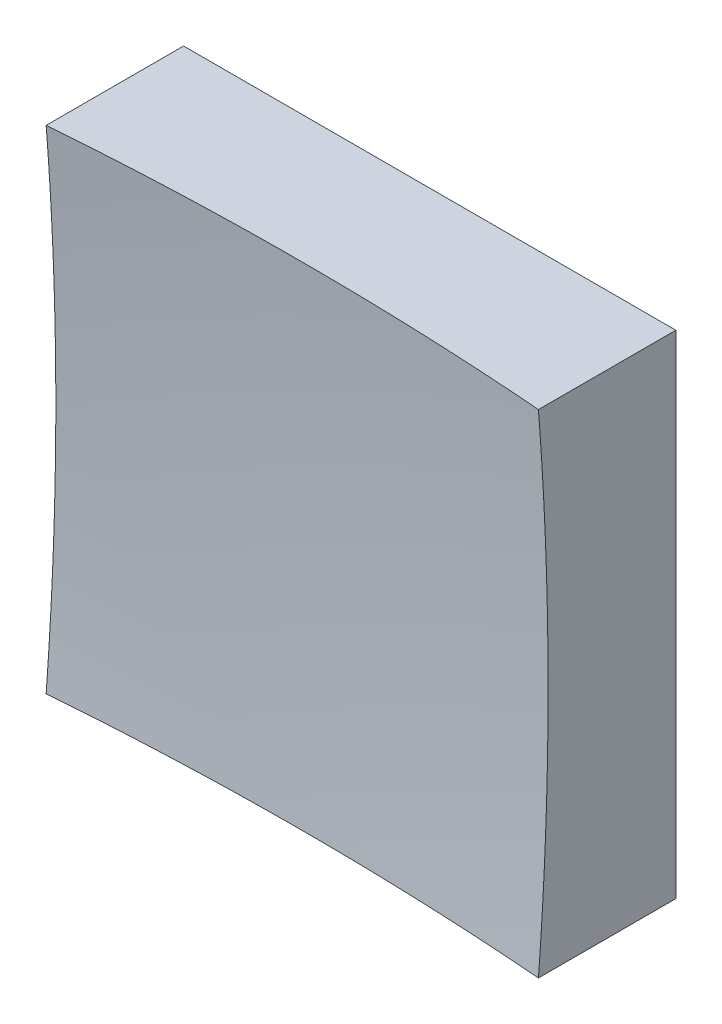
ISO-10303-21;
HEADER;
FILE_DESCRIPTION(('STEP AP214'),'2;1');
FILE_NAME('part.step','',(''),(''),'','','');
FILE_SCHEMA(('AUTOMOTIVE_DESIGN { 1 0 10303 214 1 1 1 1 }'));
ENDSEC;
DATA;
#1=APPLICATION_CONTEXT('core data for automotive mechanical design processes');
#2=APPLICATION_PROTOCOL_DEFINITION('international standard','automotive_design',2000,#1);
#3=PRODUCT_CONTEXT('',#1,'mechanical');
#4=PRODUCT('Part','Part','',(#3));
#5=PRODUCT_RELATED_PRODUCT_CATEGORY('part','',(#4));
#6=PRODUCT_DEFINITION_FORMATION('','',#4);
#7=PRODUCT_DEFINITION_CONTEXT('part definition',#1,'design');
#8=PRODUCT_DEFINITION('design','',#6,#7);
#9=PRODUCT_DEFINITION_SHAPE('','',#8);
#10=(LENGTH_UNIT() NAMED_UNIT(*) SI_UNIT(.MILLI.,.METRE.));
#11=(NAMED_UNIT(*) PLANE_ANGLE_UNIT() SI_UNIT($,.RADIAN.));
#12=(NAMED_UNIT(*) SI_UNIT($,.STERADIAN.) SOLID_ANGLE_UNIT());
#13=UNCERTAINTY_MEASURE_WITH_UNIT(LENGTH_MEASURE(1.E-05),#10,'distance_accuracy_value','');
#14=(GEOMETRIC_REPRESENTATION_CONTEXT(3) GLOBAL_UNCERTAINTY_ASSIGNED_CONTEXT((#13)) GLOBAL_UNIT_ASSIGNED_CONTEXT((#10,
#11,#12)) REPRESENTATION_CONTEXT('',''));
#15=CARTESIAN_POINT('',(0.,0.,0.));
#16=DIRECTION('',(0.,0.,1.));
#17=DIRECTION('',(1.,0.,0.));
#18=AXIS2_PLACEMENT_3D('',#15,#16,#17);
#19=CARTESIAN_POINT('',(-6.25,6.25,10.));
#20=DIRECTION('',(0.,1.,0.));
#21=DIRECTION('',(0.,0.,1.));
#22=AXIS2_PLACEMENT_3D('',#19,#20,#21);
#23=PLANE('',#22);
#24=CARTESIAN_POINT('',(0.,6.25,83.));
#25=DIRECTION('',(0.,1.,0.));
#26=DIRECTION('',(0.,0.,1.));
#27=AXIS2_PLACEMENT_3D('',#24,#25,#26);
#28=CIRCLE('',#27,79.7554857047463);
#29=CARTESIAN_POINT('',(6.25,6.25,3.48978053105375));
#30=VERTEX_POINT('',#29);
#31=CARTESIAN_POINT('',(-6.25,6.25,3.48978053105375));
#32=VERTEX_POINT('',#31);
#33=EDGE_CURVE('E79',#30,#32,#28,.T.);
#34=ORIENTED_EDGE('',*,*,#33,.F.);
#35=DIRECTION('',(0.,0.,-1.));
#36=VECTOR('',#35,1.);
#37=CARTESIAN_POINT('',(6.25,6.25,10.));
#38=LINE('',#37,#36);
#39=CARTESIAN_POINT('',(6.25,6.25,0.));
#40=VERTEX_POINT('',#39);
#41=EDGE_CURVE('E85',#30,#40,#38,.T.);
#42=ORIENTED_EDGE('',*,*,#41,.T.);
#43=DIRECTION('',(1.,0.,0.));
#44=VECTOR('',#43,1.);
#45=CARTESIAN_POINT('',(-6.25,6.25,0.));
#46=LINE('',#45,#44);
#47=CARTESIAN_POINT('',(-6.25,6.25,0.));
#48=VERTEX_POINT('',#47);
#49=EDGE_CURVE('E88',#48,#40,#46,.T.);
#50=ORIENTED_EDGE('',*,*,#49,.F.);
#51=DIRECTION('',(0.,0.,-1.));
#52=VECTOR('',#51,1.);
#53=CARTESIAN_POINT('',(-6.25,6.25,10.));
#54=LINE('',#53,#52);
#55=EDGE_CURVE('E47',#32,#48,#54,.T.);
#56=ORIENTED_EDGE('',*,*,#55,.F.);
#57=EDGE_LOOP('',(#34,#42,#50,#56));
#58=FACE_BOUND('',#57,.T.);
#59=ADVANCED_FACE('F39',(#58),#23,.T.);
#60=CARTESIAN_POINT('',(-6.25,6.25,10.));
#61=DIRECTION('',(1.,0.,0.));
#62=DIRECTION('',(0.,0.,-1.));
#63=AXIS2_PLACEMENT_3D('',#60,#61,#62);
#64=PLANE('',#63);
#65=DIRECTION('',(0.,0.,-1.));
#66=VECTOR('',#65,1.);
#67=CARTESIAN_POINT('',(-6.25,-6.25,10.));
#68=LINE('',#67,#66);
#69=CARTESIAN_POINT('',(-6.25,-6.25,3.48978053105375));
#70=VERTEX_POINT('',#69);
#71=CARTESIAN_POINT('',(-6.25,-6.25,0.));
#72=VERTEX_POINT('',#71);
#73=EDGE_CURVE('E100',#70,#72,#68,.T.);
#74=ORIENTED_EDGE('',*,*,#73,.F.);
#75=CARTESIAN_POINT('',(-6.25,0.,83.));
#76=DIRECTION('',(1.,0.,0.));
#77=DIRECTION('',(0.,0.,-1.));
#78=AXIS2_PLACEMENT_3D('',#75,#76,#77);
#79=CIRCLE('',#78,79.7554857047463);
#80=EDGE_CURVE('E89',#70,#32,#79,.T.);
#81=ORIENTED_EDGE('',*,*,#80,.T.);
#82=ORIENTED_EDGE('',*,*,#55,.T.);
#83=DIRECTION('',(0.,-1.,0.));
#84=VECTOR('',#83,1.);
#85=CARTESIAN_POINT('',(-6.25,6.25,0.));
#86=LINE('',#85,#84);
#87=EDGE_CURVE('E97',#48,#72,#86,.T.);
#88=ORIENTED_EDGE('',*,*,#87,.T.);
#89=EDGE_LOOP('',(#74,#81,#82,#88));
#90=FACE_BOUND('',#89,.T.);
#91=ADVANCED_FACE('F122',(#90),#64,.F.);
#92=CARTESIAN_POINT('',(-6.25,-6.25,10.));
#93=DIRECTION('',(0.,1.,0.));
#94=DIRECTION('',(0.,0.,1.));
#95=AXIS2_PLACEMENT_3D('',#92,#93,#94);
#96=PLANE('',#95);
#97=DIRECTION('',(0.,0.,-1.));
#98=VECTOR('',#97,1.);
#99=CARTESIAN_POINT('',(6.25,-6.25,10.));
#100=LINE('',#99,#98);
#101=CARTESIAN_POINT('',(6.25,-6.25,3.48978053105375));
#102=VERTEX_POINT('',#101);
#103=CARTESIAN_POINT('',(6.25,-6.25,0.));
#104=VERTEX_POINT('',#103);
#105=EDGE_CURVE('E96',#102,#104,#100,.T.);
#106=ORIENTED_EDGE('',*,*,#105,.F.);
#107=CARTESIAN_POINT('',(0.,-6.25,83.));
#108=DIRECTION('',(0.,1.,0.));
#109=DIRECTION('',(0.,0.,1.));
#110=AXIS2_PLACEMENT_3D('',#107,#108,#109);
#111=CIRCLE('',#110,79.7554857047463);
#112=EDGE_CURVE('E53',#102,#70,#111,.T.);
#113=ORIENTED_EDGE('',*,*,#112,.T.);
#114=ORIENTED_EDGE('',*,*,#73,.T.);
#115=DIRECTION('',(1.,0.,0.));
#116=VECTOR('',#115,1.);
#117=CARTESIAN_POINT('',(-6.25,-6.25,0.));
#118=LINE('',#117,#116);
#119=EDGE_CURVE('E102',#72,#104,#118,.T.);
#120=ORIENTED_EDGE('',*,*,#119,.T.);
#121=EDGE_LOOP('',(#106,#113,#114,#120));
#122=FACE_BOUND('',#121,.T.);
#123=ADVANCED_FACE('F121',(#122),#96,.F.);
#124=CARTESIAN_POINT('',(6.25,6.25,10.));
#125=DIRECTION('',(1.,0.,0.));
#126=DIRECTION('',(0.,0.,-1.));
#127=AXIS2_PLACEMENT_3D('',#124,#125,#126);
#128=PLANE('',#127);
#129=CARTESIAN_POINT('',(6.25,0.,83.));
#130=DIRECTION('',(1.,0.,0.));
#131=DIRECTION('',(0.,0.,-1.));
#132=AXIS2_PLACEMENT_3D('',#129,#130,#131);
#133=CIRCLE('',#132,79.7554857047463);
#134=EDGE_CURVE('E11',#102,#30,#133,.T.);
#135=ORIENTED_EDGE('',*,*,#134,.F.);
#136=ORIENTED_EDGE('',*,*,#105,.T.);
#137=DIRECTION('',(0.,-1.,0.));
#138=VECTOR('',#137,1.);
#139=CARTESIAN_POINT('',(6.25,6.25,0.));
#140=LINE('',#139,#138);
#141=EDGE_CURVE('E93',#40,#104,#140,.T.);
#142=ORIENTED_EDGE('',*,*,#141,.F.);
#143=ORIENTED_EDGE('',*,*,#41,.F.);
#144=EDGE_LOOP('',(#135,#136,#142,#143));
#145=FACE_BOUND('',#144,.T.);
#146=ADVANCED_FACE('F91',(#145),#128,.T.);
#147=CARTESIAN_POINT('',(0.,0.,0.));
#148=DIRECTION('',(0.,0.,-1.));
#149=DIRECTION('',(-1.,0.,0.));
#150=AXIS2_PLACEMENT_3D('',#147,#148,#149);
#151=PLANE('',#150);
#152=ORIENTED_EDGE('',*,*,#49,.T.);
#153=ORIENTED_EDGE('',*,*,#141,.T.);
#154=ORIENTED_EDGE('',*,*,#119,.F.);
#155=ORIENTED_EDGE('',*,*,#87,.F.);
#156=EDGE_LOOP('',(#152,#153,#154,#155));
#157=FACE_BOUND('',#156,.T.);
#158=ADVANCED_FACE('F125',(#157),#151,.T.);
#159=CARTESIAN_POINT('',(0.,0.,83.));
#160=DIRECTION('',(0.,0.,1.));
#161=DIRECTION('',(1.,0.,0.));
#162=AXIS2_PLACEMENT_3D('',#159,#160,#161);
#163=SPHERICAL_SURFACE('',#162,80.);
#164=ORIENTED_EDGE('',*,*,#33,.T.);
#165=ORIENTED_EDGE('',*,*,#80,.F.);
#166=ORIENTED_EDGE('',*,*,#112,.F.);
#167=ORIENTED_EDGE('',*,*,#134,.T.);
#168=EDGE_LOOP('',(#164,#165,#166,#167));
#169=FACE_BOUND('',#168,.T.);
#170=ADVANCED_FACE('F78',(#169),#163,.F.);
#171=CLOSED_SHELL('',(#59,#91,#123,#146,#158,#170));
#172=MANIFOLD_SOLID_BREP('B2',#171);
#173=ADVANCED_BREP_SHAPE_REPRESENTATION('',(#18,#172),#14);
#174=SHAPE_DEFINITION_REPRESENTATION(#9,#173);
ENDSEC;
END-ISO-10303-21;
